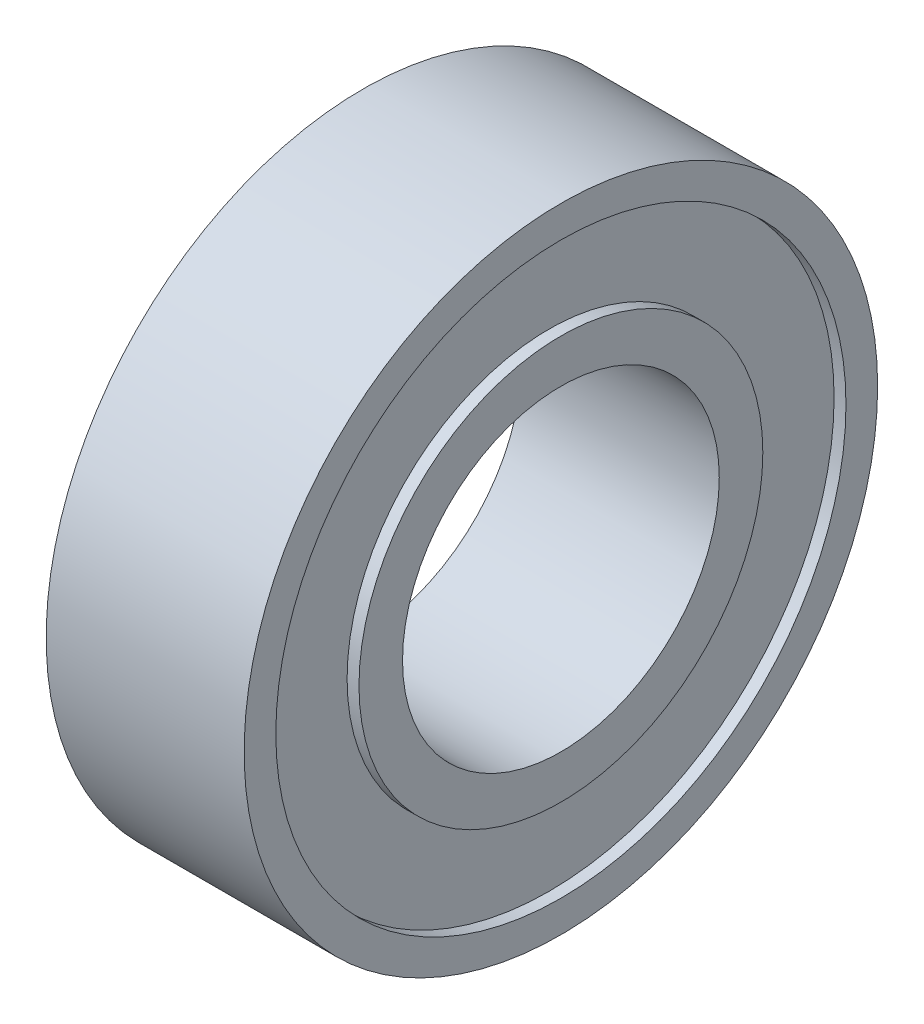
ISO-10303-21;
HEADER;
FILE_DESCRIPTION(('STEP AP214'),'2;1');
FILE_NAME('part.step','',(''),(''),'','','');
FILE_SCHEMA(('AUTOMOTIVE_DESIGN { 1 0 10303 214 1 1 1 1 }'));
ENDSEC;
DATA;
#1=APPLICATION_CONTEXT('core data for automotive mechanical design processes');
#2=APPLICATION_PROTOCOL_DEFINITION('international standard','automotive_design',2000,#1);
#3=PRODUCT_CONTEXT('',#1,'mechanical');
#4=PRODUCT('Part','Part','',(#3));
#5=PRODUCT_RELATED_PRODUCT_CATEGORY('part','',(#4));
#6=PRODUCT_DEFINITION_FORMATION('','',#4);
#7=PRODUCT_DEFINITION_CONTEXT('part definition',#1,'design');
#8=PRODUCT_DEFINITION('design','',#6,#7);
#9=PRODUCT_DEFINITION_SHAPE('','',#8);
#10=(LENGTH_UNIT() NAMED_UNIT(*) SI_UNIT(.MILLI.,.METRE.));
#11=(NAMED_UNIT(*) PLANE_ANGLE_UNIT() SI_UNIT($,.RADIAN.));
#12=(NAMED_UNIT(*) SI_UNIT($,.STERADIAN.) SOLID_ANGLE_UNIT());
#13=UNCERTAINTY_MEASURE_WITH_UNIT(LENGTH_MEASURE(1.E-05),#10,'distance_accuracy_value','');
#14=(GEOMETRIC_REPRESENTATION_CONTEXT(3) GLOBAL_UNCERTAINTY_ASSIGNED_CONTEXT((#13)) GLOBAL_UNIT_ASSIGNED_CONTEXT((#10,
#11,#12)) REPRESENTATION_CONTEXT('',''));
#15=CARTESIAN_POINT('',(0.,0.,0.));
#16=DIRECTION('',(0.,0.,1.));
#17=DIRECTION('',(1.,0.,0.));
#18=AXIS2_PLACEMENT_3D('',#15,#16,#17);
#19=CARTESIAN_POINT('',(-2.5,4.,0.));
#20=DIRECTION('',(-1.,0.,0.));
#21=DIRECTION('',(0.,0.,1.));
#22=AXIS2_PLACEMENT_3D('',#19,#20,#21);
#23=PLANE('',#22);
#24=CARTESIAN_POINT('',(-2.5,0.,0.));
#25=DIRECTION('',(1.,0.,0.));
#26=DIRECTION('',(0.,0.,-1.));
#27=AXIS2_PLACEMENT_3D('',#24,#25,#26);
#28=CIRCLE('',#27,4.);
#29=CARTESIAN_POINT('',(-2.5,0.,-4.));
#30=VERTEX_POINT('',#29);
#31=EDGE_CURVE('E75',#30,#30,#28,.T.);
#32=ORIENTED_EDGE('',*,*,#31,.T.);
#33=EDGE_LOOP('',(#32));
#34=FACE_BOUND('',#33,.T.);
#35=CARTESIAN_POINT('',(-2.5,0.,0.));
#36=DIRECTION('',(1.,0.,0.));
#37=DIRECTION('',(0.,0.,-1.));
#38=AXIS2_PLACEMENT_3D('',#35,#36,#37);
#39=CIRCLE('',#38,5.1);
#40=CARTESIAN_POINT('',(-2.5,0.,-5.1));
#41=VERTEX_POINT('',#40);
#42=EDGE_CURVE('E10',#41,#41,#39,.T.);
#43=ORIENTED_EDGE('',*,*,#42,.F.);
#44=EDGE_LOOP('',(#43));
#45=FACE_BOUND('',#44,.T.);
#46=ADVANCED_FACE('F35',(#34,#45),#23,.T.);
#47=CARTESIAN_POINT('',(0.,0.,0.));
#48=DIRECTION('',(1.,0.,0.));
#49=DIRECTION('',(0.,0.,-1.));
#50=AXIS2_PLACEMENT_3D('',#47,#48,#49);
#51=CYLINDRICAL_SURFACE('',#50,5.1);
#52=ORIENTED_EDGE('',*,*,#42,.T.);
#53=EDGE_LOOP('',(#52));
#54=FACE_BOUND('',#53,.T.);
#55=CARTESIAN_POINT('',(-2.2,0.,0.));
#56=DIRECTION('',(1.,0.,0.));
#57=DIRECTION('',(0.,0.,-1.));
#58=AXIS2_PLACEMENT_3D('',#55,#56,#57);
#59=CIRCLE('',#58,5.1);
#60=CARTESIAN_POINT('',(-2.2,0.,-5.1));
#61=VERTEX_POINT('',#60);
#62=EDGE_CURVE('E41',#61,#61,#59,.T.);
#63=ORIENTED_EDGE('',*,*,#62,.F.);
#64=EDGE_LOOP('',(#63));
#65=FACE_BOUND('',#64,.T.);
#66=ADVANCED_FACE('F93',(#54,#65),#51,.T.);
#67=CARTESIAN_POINT('',(-2.2,5.1,0.));
#68=DIRECTION('',(-1.,0.,0.));
#69=DIRECTION('',(0.,0.,1.));
#70=AXIS2_PLACEMENT_3D('',#67,#68,#69);
#71=PLANE('',#70);
#72=ORIENTED_EDGE('',*,*,#62,.T.);
#73=EDGE_LOOP('',(#72));
#74=FACE_BOUND('',#73,.T.);
#75=CARTESIAN_POINT('',(-2.2,0.,0.));
#76=DIRECTION('',(1.,0.,0.));
#77=DIRECTION('',(0.,0.,-1.));
#78=AXIS2_PLACEMENT_3D('',#75,#76,#77);
#79=CIRCLE('',#78,7.2);
#80=CARTESIAN_POINT('',(-2.2,0.,-7.2));
#81=VERTEX_POINT('',#80);
#82=EDGE_CURVE('E45',#81,#81,#79,.T.);
#83=ORIENTED_EDGE('',*,*,#82,.F.);
#84=EDGE_LOOP('',(#83));
#85=FACE_BOUND('',#84,.T.);
#86=ADVANCED_FACE('F97',(#74,#85),#71,.T.);
#87=CARTESIAN_POINT('',(0.,0.,0.));
#88=DIRECTION('',(1.,0.,0.));
#89=DIRECTION('',(0.,0.,-1.));
#90=AXIS2_PLACEMENT_3D('',#87,#88,#89);
#91=CYLINDRICAL_SURFACE('',#90,7.2);
#92=ORIENTED_EDGE('',*,*,#82,.T.);
#93=EDGE_LOOP('',(#92));
#94=FACE_BOUND('',#93,.T.);
#95=CARTESIAN_POINT('',(-2.5,0.,0.));
#96=DIRECTION('',(1.,0.,0.));
#97=DIRECTION('',(0.,0.,-1.));
#98=AXIS2_PLACEMENT_3D('',#95,#96,#97);
#99=CIRCLE('',#98,7.2);
#100=CARTESIAN_POINT('',(-2.5,0.,-7.2));
#101=VERTEX_POINT('',#100);
#102=EDGE_CURVE('E49',#101,#101,#99,.T.);
#103=ORIENTED_EDGE('',*,*,#102,.F.);
#104=EDGE_LOOP('',(#103));
#105=FACE_BOUND('',#104,.T.);
#106=ADVANCED_FACE('F101',(#94,#105),#91,.F.);
#107=CARTESIAN_POINT('',(-2.5,7.2,0.));
#108=DIRECTION('',(-1.,0.,0.));
#109=DIRECTION('',(0.,0.,1.));
#110=AXIS2_PLACEMENT_3D('',#107,#108,#109);
#111=PLANE('',#110);
#112=ORIENTED_EDGE('',*,*,#102,.T.);
#113=EDGE_LOOP('',(#112));
#114=FACE_BOUND('',#113,.T.);
#115=CARTESIAN_POINT('',(-2.5,0.,0.));
#116=DIRECTION('',(1.,0.,0.));
#117=DIRECTION('',(0.,0.,-1.));
#118=AXIS2_PLACEMENT_3D('',#115,#116,#117);
#119=CIRCLE('',#118,8.);
#120=CARTESIAN_POINT('',(-2.5,0.,-8.));
#121=VERTEX_POINT('',#120);
#122=EDGE_CURVE('E54',#121,#121,#119,.T.);
#123=ORIENTED_EDGE('',*,*,#122,.F.);
#124=EDGE_LOOP('',(#123));
#125=FACE_BOUND('',#124,.T.);
#126=ADVANCED_FACE('F107',(#114,#125),#111,.T.);
#127=CARTESIAN_POINT('',(0.,0.,0.));
#128=DIRECTION('',(1.,0.,0.));
#129=DIRECTION('',(0.,0.,-1.));
#130=AXIS2_PLACEMENT_3D('',#127,#128,#129);
#131=CYLINDRICAL_SURFACE('',#130,8.);
#132=ORIENTED_EDGE('',*,*,#122,.T.);
#133=EDGE_LOOP('',(#132));
#134=FACE_BOUND('',#133,.T.);
#135=CARTESIAN_POINT('',(2.5,0.,0.));
#136=DIRECTION('',(1.,0.,0.));
#137=DIRECTION('',(0.,0.,-1.));
#138=AXIS2_PLACEMENT_3D('',#135,#136,#137);
#139=CIRCLE('',#138,8.);
#140=CARTESIAN_POINT('',(2.5,0.,-8.));
#141=VERTEX_POINT('',#140);
#142=EDGE_CURVE('E57',#141,#141,#139,.T.);
#143=ORIENTED_EDGE('',*,*,#142,.F.);
#144=EDGE_LOOP('',(#143));
#145=FACE_BOUND('',#144,.T.);
#146=ADVANCED_FACE('F111',(#134,#145),#131,.T.);
#147=CARTESIAN_POINT('',(2.5,7.2,0.));
#148=DIRECTION('',(1.,0.,0.));
#149=DIRECTION('',(0.,0.,-1.));
#150=AXIS2_PLACEMENT_3D('',#147,#148,#149);
#151=PLANE('',#150);
#152=ORIENTED_EDGE('',*,*,#142,.T.);
#153=EDGE_LOOP('',(#152));
#154=FACE_BOUND('',#153,.T.);
#155=CARTESIAN_POINT('',(2.5,0.,0.));
#156=DIRECTION('',(1.,0.,0.));
#157=DIRECTION('',(0.,0.,-1.));
#158=AXIS2_PLACEMENT_3D('',#155,#156,#157);
#159=CIRCLE('',#158,7.2);
#160=CARTESIAN_POINT('',(2.5,0.,-7.2));
#161=VERTEX_POINT('',#160);
#162=EDGE_CURVE('E60',#161,#161,#159,.T.);
#163=ORIENTED_EDGE('',*,*,#162,.F.);
#164=EDGE_LOOP('',(#163));
#165=FACE_BOUND('',#164,.T.);
#166=ADVANCED_FACE('F115',(#154,#165),#151,.T.);
#167=CARTESIAN_POINT('',(0.,0.,0.));
#168=DIRECTION('',(1.,0.,0.));
#169=DIRECTION('',(0.,0.,-1.));
#170=AXIS2_PLACEMENT_3D('',#167,#168,#169);
#171=CYLINDRICAL_SURFACE('',#170,7.2);
#172=ORIENTED_EDGE('',*,*,#162,.T.);
#173=EDGE_LOOP('',(#172));
#174=FACE_BOUND('',#173,.T.);
#175=CARTESIAN_POINT('',(2.2,0.,0.));
#176=DIRECTION('',(1.,0.,0.));
#177=DIRECTION('',(0.,0.,-1.));
#178=AXIS2_PLACEMENT_3D('',#175,#176,#177);
#179=CIRCLE('',#178,7.2);
#180=CARTESIAN_POINT('',(2.2,0.,-7.2));
#181=VERTEX_POINT('',#180);
#182=EDGE_CURVE('E63',#181,#181,#179,.T.);
#183=ORIENTED_EDGE('',*,*,#182,.F.);
#184=EDGE_LOOP('',(#183));
#185=FACE_BOUND('',#184,.T.);
#186=ADVANCED_FACE('F119',(#174,#185),#171,.F.);
#187=CARTESIAN_POINT('',(2.2,5.1,0.));
#188=DIRECTION('',(1.,0.,0.));
#189=DIRECTION('',(0.,0.,-1.));
#190=AXIS2_PLACEMENT_3D('',#187,#188,#189);
#191=PLANE('',#190);
#192=ORIENTED_EDGE('',*,*,#182,.T.);
#193=EDGE_LOOP('',(#192));
#194=FACE_BOUND('',#193,.T.);
#195=CARTESIAN_POINT('',(2.2,0.,0.));
#196=DIRECTION('',(1.,0.,0.));
#197=DIRECTION('',(0.,0.,-1.));
#198=AXIS2_PLACEMENT_3D('',#195,#196,#197);
#199=CIRCLE('',#198,5.1);
#200=CARTESIAN_POINT('',(2.2,0.,-5.1));
#201=VERTEX_POINT('',#200);
#202=EDGE_CURVE('E66',#201,#201,#199,.T.);
#203=ORIENTED_EDGE('',*,*,#202,.F.);
#204=EDGE_LOOP('',(#203));
#205=FACE_BOUND('',#204,.T.);
#206=ADVANCED_FACE('F123',(#194,#205),#191,.T.);
#207=CARTESIAN_POINT('',(0.,0.,0.));
#208=DIRECTION('',(1.,0.,0.));
#209=DIRECTION('',(0.,0.,-1.));
#210=AXIS2_PLACEMENT_3D('',#207,#208,#209);
#211=CYLINDRICAL_SURFACE('',#210,5.1);
#212=ORIENTED_EDGE('',*,*,#202,.T.);
#213=EDGE_LOOP('',(#212));
#214=FACE_BOUND('',#213,.T.);
#215=CARTESIAN_POINT('',(2.5,0.,0.));
#216=DIRECTION('',(1.,0.,0.));
#217=DIRECTION('',(0.,0.,-1.));
#218=AXIS2_PLACEMENT_3D('',#215,#216,#217);
#219=CIRCLE('',#218,5.1);
#220=CARTESIAN_POINT('',(2.5,0.,-5.1));
#221=VERTEX_POINT('',#220);
#222=EDGE_CURVE('E69',#221,#221,#219,.T.);
#223=ORIENTED_EDGE('',*,*,#222,.F.);
#224=EDGE_LOOP('',(#223));
#225=FACE_BOUND('',#224,.T.);
#226=ADVANCED_FACE('F89',(#214,#225),#211,.T.);
#227=CARTESIAN_POINT('',(2.5,4.,0.));
#228=DIRECTION('',(1.,0.,0.));
#229=DIRECTION('',(0.,0.,-1.));
#230=AXIS2_PLACEMENT_3D('',#227,#228,#229);
#231=PLANE('',#230);
#232=ORIENTED_EDGE('',*,*,#222,.T.);
#233=EDGE_LOOP('',(#232));
#234=FACE_BOUND('',#233,.T.);
#235=CARTESIAN_POINT('',(2.5,0.,0.));
#236=DIRECTION('',(1.,0.,0.));
#237=DIRECTION('',(0.,0.,-1.));
#238=AXIS2_PLACEMENT_3D('',#235,#236,#237);
#239=CIRCLE('',#238,4.);
#240=CARTESIAN_POINT('',(2.5,0.,-4.));
#241=VERTEX_POINT('',#240);
#242=EDGE_CURVE('E72',#241,#241,#239,.T.);
#243=ORIENTED_EDGE('',*,*,#242,.F.);
#244=EDGE_LOOP('',(#243));
#245=FACE_BOUND('',#244,.T.);
#246=ADVANCED_FACE('F83',(#234,#245),#231,.T.);
#247=CARTESIAN_POINT('',(0.,0.,0.));
#248=DIRECTION('',(1.,0.,0.));
#249=DIRECTION('',(0.,0.,-1.));
#250=AXIS2_PLACEMENT_3D('',#247,#248,#249);
#251=CYLINDRICAL_SURFACE('',#250,4.);
#252=ORIENTED_EDGE('',*,*,#242,.T.);
#253=EDGE_LOOP('',(#252));
#254=FACE_BOUND('',#253,.T.);
#255=ORIENTED_EDGE('',*,*,#31,.F.);
#256=EDGE_LOOP('',(#255));
#257=FACE_BOUND('',#256,.T.);
#258=ADVANCED_FACE('F81',(#254,#257),#251,.F.);
#259=CLOSED_SHELL('',(#46,#66,#86,#106,#126,#146,#166,#186,#206,#226,#246,#258));
#260=MANIFOLD_SOLID_BREP('B2',#259);
#261=ADVANCED_BREP_SHAPE_REPRESENTATION('',(#18,#260),#14);
#262=SHAPE_DEFINITION_REPRESENTATION(#9,#261);
ENDSEC;
END-ISO-10303-21;
